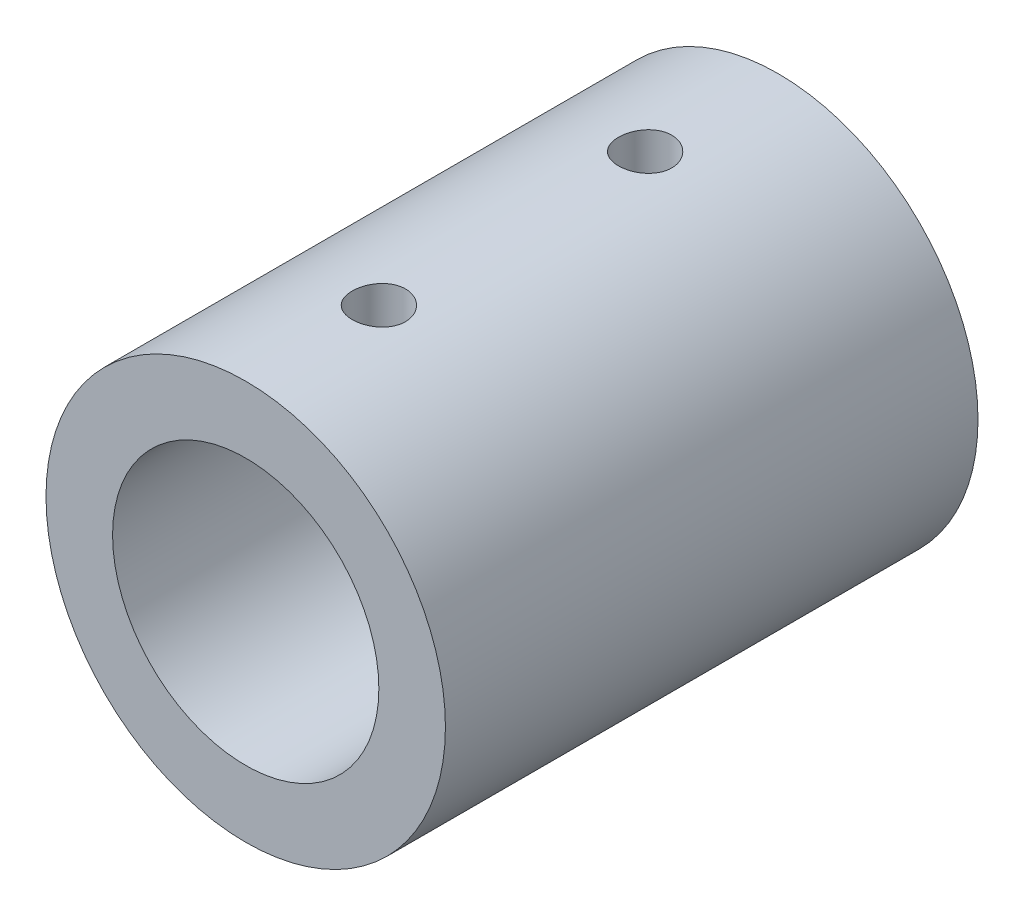
ISO-10303-21;
HEADER;
FILE_DESCRIPTION(('STEP AP214'),'2;1');
FILE_NAME('part.step','',(''),(''),'','','');
FILE_SCHEMA(('AUTOMOTIVE_DESIGN { 1 0 10303 214 1 1 1 1 }'));
ENDSEC;
DATA;
#1=APPLICATION_CONTEXT('core data for automotive mechanical design processes');
#2=APPLICATION_PROTOCOL_DEFINITION('international standard','automotive_design',2000,#1);
#3=PRODUCT_CONTEXT('',#1,'mechanical');
#4=PRODUCT('Part','Part','',(#3));
#5=PRODUCT_RELATED_PRODUCT_CATEGORY('part','',(#4));
#6=PRODUCT_DEFINITION_FORMATION('','',#4);
#7=PRODUCT_DEFINITION_CONTEXT('part definition',#1,'design');
#8=PRODUCT_DEFINITION('design','',#6,#7);
#9=PRODUCT_DEFINITION_SHAPE('','',#8);
#10=(LENGTH_UNIT() NAMED_UNIT(*) SI_UNIT(.MILLI.,.METRE.));
#11=(NAMED_UNIT(*) PLANE_ANGLE_UNIT() SI_UNIT($,.RADIAN.));
#12=(NAMED_UNIT(*) SI_UNIT($,.STERADIAN.) SOLID_ANGLE_UNIT());
#13=UNCERTAINTY_MEASURE_WITH_UNIT(LENGTH_MEASURE(1.E-05),#10,'distance_accuracy_value','');
#14=(GEOMETRIC_REPRESENTATION_CONTEXT(3) GLOBAL_UNCERTAINTY_ASSIGNED_CONTEXT((#13)) GLOBAL_UNIT_ASSIGNED_CONTEXT((#10,
#11,#12)) REPRESENTATION_CONTEXT('',''));
#15=CARTESIAN_POINT('',(0.,0.,0.));
#16=DIRECTION('',(0.,0.,1.));
#17=DIRECTION('',(1.,0.,0.));
#18=AXIS2_PLACEMENT_3D('',#15,#16,#17);
#19=CARTESIAN_POINT('',(0.,0.,-30.));
#20=DIRECTION('',(0.,0.,1.));
#21=DIRECTION('',(1.,0.,0.));
#22=AXIS2_PLACEMENT_3D('',#19,#20,#21);
#23=CYLINDRICAL_SURFACE('',#22,22.5);
#24=CARTESIAN_POINT('',(0.,22.5,-18.));
#25=CARTESIAN_POINT('',(-0.167713253503927,22.4999975361382,-17.9999929354396));
#26=CARTESIAN_POINT('',(-0.33552896891442,22.4981050609079,-17.9858886930563));
#27=CARTESIAN_POINT('',(-0.666484087707118,22.4907376669036,-17.9298504764257));
#28=CARTESIAN_POINT('',(-0.829618533499555,22.4852590866259,-17.8878880576543));
#29=CARTESIAN_POINT('',(-1.14637246894048,22.471336197736,-17.7773974236878));
#30=CARTESIAN_POINT('',(-1.29999852458774,22.4628939631646,-17.7088877834423));
#31=CARTESIAN_POINT('',(-1.59354584254545,22.4439807999059,-17.5472896292906));
#32=CARTESIAN_POINT('',(-1.73346930950554,22.4335101983785,-17.4542050782503));
#33=CARTESIAN_POINT('',(-1.99653873375702,22.4116349218495,-17.2454801075937));
#34=CARTESIAN_POINT('',(-2.11958697824379,22.4002253724317,-17.1297170324873));
#35=CARTESIAN_POINT('',(-2.34457103509652,22.3777970633693,-16.879184716385));
#36=CARTESIAN_POINT('',(-2.44650572995832,22.3667783244351,-16.7444144700063));
#37=CARTESIAN_POINT('',(-2.62673853403361,22.3463315316028,-16.4590513155824));
#38=CARTESIAN_POINT('',(-2.70494411223867,22.3369097664864,-16.3083994762821));
#39=CARTESIAN_POINT('',(-2.83490767510935,22.3207888106885,-15.9959533991448));
#40=CARTESIAN_POINT('',(-2.88666679867917,22.3140895027681,-15.83415964147));
#41=CARTESIAN_POINT('',(-2.96196910158261,22.30421904853,-15.5050412842475));
#42=CARTESIAN_POINT('',(-2.9856780634276,22.301027180552,-15.3377552482006));
#43=CARTESIAN_POINT('',(-3.00472020822176,22.2984697741397,-15.0015507305911));
#44=CARTESIAN_POINT('',(-3.00005468450402,22.299104061306,-14.8326323237837));
#45=CARTESIAN_POINT('',(-2.96261618908852,22.3041083365948,-14.4991183049581));
#46=CARTESIAN_POINT('',(-2.93002646297642,22.3084539693351,-14.3345017051714));
#47=CARTESIAN_POINT('',(-2.83795086951557,22.3203532916212,-14.0130947448599));
#48=CARTESIAN_POINT('',(-2.77846438892186,22.3279070543119,-13.8563045628675));
#49=CARTESIAN_POINT('',(-2.63408893714787,22.3453989166654,-13.5544355479392));
#50=CARTESIAN_POINT('',(-2.54912096870624,22.3553444118585,-13.4093949432085));
#51=CARTESIAN_POINT('',(-2.35625090016434,22.376493543299,-13.1355613771235));
#52=CARTESIAN_POINT('',(-2.24834760753577,22.3876972449529,-13.0067692611687));
#53=CARTESIAN_POINT('',(-2.01165735039544,22.4102084885038,-12.7680254811272));
#54=CARTESIAN_POINT('',(-1.88271256053967,22.421516153118,-12.6582302359465));
#55=CARTESIAN_POINT('',(-1.60814125520011,22.442878857274,-12.4618169326074));
#56=CARTESIAN_POINT('',(-1.46251469166355,22.4529338932073,-12.3751989412147));
#57=CARTESIAN_POINT('',(-1.15858832959571,22.4706659061537,-12.2275963234579));
#58=CARTESIAN_POINT('',(-1.00028336826185,22.4783419081344,-12.1666222034305));
#59=CARTESIAN_POINT('',(-0.675556386504375,22.4904423885611,-12.0721660215415));
#60=CARTESIAN_POINT('',(-0.509134799313386,22.4948670403489,-12.0386824940409));
#61=CARTESIAN_POINT('',(-0.174250354988466,22.4999436206528,-12.0003623508433));
#62=CARTESIAN_POINT('',(-0.00581255182056345,22.5006239077357,-11.9953103973248));
#63=CARTESIAN_POINT('',(0.329507425828077,22.4982118730778,-12.0134274961908));
#64=CARTESIAN_POINT('',(0.496389638018497,22.495119643029,-12.0365958626735));
#65=CARTESIAN_POINT('',(0.823220573359407,22.4855276303715,-12.110316980076));
#66=CARTESIAN_POINT('',(0.983193024768067,22.4790407145438,-12.1607663524832));
#67=CARTESIAN_POINT('',(1.29240764819034,22.4633851388143,-12.2875094489056));
#68=CARTESIAN_POINT('',(1.44164941052346,22.4542163765916,-12.3638041590199));
#69=CARTESIAN_POINT('',(1.72612331792412,22.4341475605511,-12.540588233375));
#70=CARTESIAN_POINT('',(1.86126872159491,22.4232377256857,-12.64121604857));
#71=CARTESIAN_POINT('',(2.11282942048785,22.4009359306497,-12.8636149938364));
#72=CARTESIAN_POINT('',(2.22924386493568,22.3895439486093,-12.9853870837747));
#73=CARTESIAN_POINT('',(2.44080824134647,22.3674735371027,-13.2475697139593));
#74=CARTESIAN_POINT('',(2.53581491413408,22.3568002316295,-13.3880963501072));
#75=CARTESIAN_POINT('',(2.70087526618221,22.3374619950273,-13.6832391154214));
#76=CARTESIAN_POINT('',(2.7709295026552,22.3287970190518,-13.8378549298656));
#77=CARTESIAN_POINT('',(2.88386754751119,22.3144921767012,-14.1563358630415));
#78=CARTESIAN_POINT('',(2.92683043270193,22.308843513489,-14.3201725278162));
#79=CARTESIAN_POINT('',(2.98462000715938,22.3011862304744,-14.6528154481931));
#80=CARTESIAN_POINT('',(2.99944820140173,22.2991774159701,-14.8216214374867));
#81=CARTESIAN_POINT('',(3.00051728709284,22.2990334694317,-15.1579852362803));
#82=CARTESIAN_POINT('',(2.98698328791739,22.3008678342378,-15.3255423614464));
#83=CARTESIAN_POINT('',(2.93219065030034,22.308137758113,-15.6559768126558));
#84=CARTESIAN_POINT('',(2.89093202224903,22.3135733158325,-15.818854140453));
#85=CARTESIAN_POINT('',(2.78193465498311,22.3274233540915,-16.1352655248774));
#86=CARTESIAN_POINT('',(2.71420831228562,22.335836439891,-16.2888039166753));
#87=CARTESIAN_POINT('',(2.55422014139606,22.3546956856923,-16.5823738257391));
#88=CARTESIAN_POINT('',(2.46195783945643,22.365141884949,-16.7224050821341));
#89=CARTESIAN_POINT('',(2.25468672764262,22.3869895077459,-16.9861344748926));
#90=CARTESIAN_POINT('',(2.13951040840351,22.3983975863112,-17.1097004216327));
#91=CARTESIAN_POINT('',(1.89003254024735,22.4208257850249,-17.3358348245423));
#92=CARTESIAN_POINT('',(1.75572651109466,22.4318458135347,-17.4383983481254));
#93=CARTESIAN_POINT('',(1.47112948177923,22.4523095270629,-17.6200007076998));
#94=CARTESIAN_POINT('',(1.32077193111595,22.4617461964033,-17.6989359998329));
#95=CARTESIAN_POINT('',(1.00888861438099,22.4779098098846,-17.8303208978176));
#96=CARTESIAN_POINT('',(0.847375018454833,22.4846396538647,-17.8827988629373));
#97=CARTESIAN_POINT('',(0.570882612147626,22.493035826149,-17.9474220095778));
#98=CARTESIAN_POINT('',(0.457636622933667,22.4956344545261,-17.9671098652855));
#99=CARTESIAN_POINT('',(0.229609757424167,22.4991173773616,-17.9934012212482));
#100=CARTESIAN_POINT('',(0.11482889467686,22.500001686942,-18.0000048369204));
#101=CARTESIAN_POINT('',(0.,22.5,-18.));
#102=B_SPLINE_CURVE_WITH_KNOTS('',3,(#24,#25,#26,#27,#28,#29,#30,#31,#32,#33,#34,#35,#36,#37,
#38,#39,#40,#41,#42,#43,#44,#45,#46,#47,#48,#49,#50,#51,#52,#53,#54,#55,#56,#57,#58,#59,#60,#61,
#62,#63,#64,#65,#66,#67,#68,#69,#70,#71,#72,#73,#74,#75,#76,#77,#78,#79,#80,#81,#82,#83,#84,#85,
#86,#87,#88,#89,#90,#91,#92,#93,#94,#95,#96,#97,#98,#99,#100,#101),.UNSPECIFIED.,.T.,.F.,(4,2,2,
2,2,2,2,2,2,2,2,2,2,2,2,2,2,2,2,2,2,2,2,2,2,2,2,2,2,2,2,2,2,2,2,2,2,2,4),(0.,0.502720276958615,
1.00595464632757,1.50883753924111,2.01163938846052,2.51723967665338,3.02286671857254,
3.53044082267471,4.03799306649307,4.54253033871538,5.0470446138738,5.54827327647065,
6.04951336763776,6.55232374706847,7.05516027665696,7.56195816727274,8.06875751778444,
8.57576430303808,9.08274405587614,9.58587877488091,10.0890012653172,10.590230450947,
11.0914787625532,11.5956491215483,12.0998423738814,12.6073155680318,13.1147774290957,
13.6207511210318,14.1266977467545,14.6286439124494,15.1305898900312,15.6323010555393,
16.1340219089385,16.6395550175266,17.1452067187674,17.6530429001177,18.1603335748863,
18.5045360857096,18.8487355602816),.UNSPECIFIED.);
#103=CARTESIAN_POINT('',(0.,22.5,-18.));
#104=VERTEX_POINT('',#103);
#105=EDGE_CURVE('E74',#104,#104,#102,.T.);
#106=ORIENTED_EDGE('',*,*,#105,.F.);
#107=EDGE_LOOP('',(#106));
#108=FACE_BOUND('',#107,.T.);
#109=CARTESIAN_POINT('',(0.,0.,30.));
#110=DIRECTION('',(0.,0.,1.));
#111=DIRECTION('',(1.,0.,0.));
#112=AXIS2_PLACEMENT_3D('',#109,#110,#111);
#113=CIRCLE('',#112,22.5);
#114=CARTESIAN_POINT('',(22.5,0.,30.));
#115=VERTEX_POINT('',#114);
#116=EDGE_CURVE('E63',#115,#115,#113,.T.);
#117=ORIENTED_EDGE('',*,*,#116,.F.);
#118=EDGE_LOOP('',(#117));
#119=FACE_BOUND('',#118,.T.);
#120=CARTESIAN_POINT('',(0.,0.,-30.));
#121=DIRECTION('',(0.,0.,1.));
#122=DIRECTION('',(1.,0.,0.));
#123=AXIS2_PLACEMENT_3D('',#120,#121,#122);
#124=CIRCLE('',#123,22.5);
#125=CARTESIAN_POINT('',(22.5,0.,-30.));
#126=VERTEX_POINT('',#125);
#127=EDGE_CURVE('E10',#126,#126,#124,.T.);
#128=ORIENTED_EDGE('',*,*,#127,.T.);
#129=EDGE_LOOP('',(#128));
#130=FACE_BOUND('',#129,.T.);
#131=CARTESIAN_POINT('',(0.,22.5,12.));
#132=CARTESIAN_POINT('',(0.167713253503927,22.4999975361382,12.0000070645604));
#133=CARTESIAN_POINT('',(0.33552896891442,22.4981050609079,12.0141113069437));
#134=CARTESIAN_POINT('',(0.666484087707118,22.4907376669036,12.0701495235743));
#135=CARTESIAN_POINT('',(0.829618533499555,22.4852590866259,12.1121119423457));
#136=CARTESIAN_POINT('',(1.14637246894048,22.471336197736,12.2226025763122));
#137=CARTESIAN_POINT('',(1.29999852458774,22.4628939631646,12.2911122165577));
#138=CARTESIAN_POINT('',(1.59354584254545,22.4439807999059,12.4527103707094));
#139=CARTESIAN_POINT('',(1.73346930950554,22.4335101983785,12.5457949217497));
#140=CARTESIAN_POINT('',(1.99653873375702,22.4116349218495,12.7545198924063));
#141=CARTESIAN_POINT('',(2.1195869782438,22.4002253724317,12.8702829675127));
#142=CARTESIAN_POINT('',(2.34457103509653,22.3777970633693,13.120815283615));
#143=CARTESIAN_POINT('',(2.44650572995832,22.3667783244351,13.2555855299937));
#144=CARTESIAN_POINT('',(2.62673853403361,22.3463315316028,13.5409486844175));
#145=CARTESIAN_POINT('',(2.70494411223867,22.3369097664864,13.6916005237179));
#146=CARTESIAN_POINT('',(2.83490767510935,22.3207888106885,14.0040466008552));
#147=CARTESIAN_POINT('',(2.88666679867917,22.3140895027681,14.16584035853));
#148=CARTESIAN_POINT('',(2.96196910158261,22.30421904853,14.4949587157525));
#149=CARTESIAN_POINT('',(2.9856780634276,22.301027180552,14.6622447517994));
#150=CARTESIAN_POINT('',(3.00472020822176,22.2984697741397,14.9984492694089));
#151=CARTESIAN_POINT('',(3.00005468450402,22.299104061306,15.1673676762163));
#152=CARTESIAN_POINT('',(2.96261618908852,22.3041083365948,15.5008816950419));
#153=CARTESIAN_POINT('',(2.93002646297642,22.3084539693351,15.6654982948286));
#154=CARTESIAN_POINT('',(2.83795086951557,22.3203532916212,15.9869052551401));
#155=CARTESIAN_POINT('',(2.77846438892186,22.3279070543119,16.1436954371325));
#156=CARTESIAN_POINT('',(2.63408893714787,22.3453989166654,16.4455644520608));
#157=CARTESIAN_POINT('',(2.54912096870624,22.3553444118585,16.5906050567915));
#158=CARTESIAN_POINT('',(2.35625090016434,22.376493543299,16.8644386228765));
#159=CARTESIAN_POINT('',(2.24834760753577,22.3876972449529,16.9932307388313));
#160=CARTESIAN_POINT('',(2.01165735039544,22.4102084885038,17.2319745188728));
#161=CARTESIAN_POINT('',(1.88271256053967,22.421516153118,17.3417697640535));
#162=CARTESIAN_POINT('',(1.60814125520011,22.442878857274,17.5381830673926));
#163=CARTESIAN_POINT('',(1.46251469166355,22.4529338932073,17.6248010587853));
#164=CARTESIAN_POINT('',(1.1585883295957,22.4706659061537,17.7724036765421));
#165=CARTESIAN_POINT('',(1.00028336826184,22.4783419081344,17.8333777965695));
#166=CARTESIAN_POINT('',(0.675556386504372,22.4904423885611,17.9278339784585));
#167=CARTESIAN_POINT('',(0.509134799313384,22.4948670403489,17.9613175059591));
#168=CARTESIAN_POINT('',(0.174250354988463,22.4999436206528,17.9996376491567));
#169=CARTESIAN_POINT('',(0.0058125518205612,22.5006239077357,18.0046896026752));
#170=CARTESIAN_POINT('',(-0.329507425828079,22.4982118730778,17.9865725038092));
#171=CARTESIAN_POINT('',(-0.496389638018499,22.495119643029,17.9634041373265));
#172=CARTESIAN_POINT('',(-0.82322057335941,22.4855276303715,17.889683019924));
#173=CARTESIAN_POINT('',(-0.983193024768071,22.4790407145438,17.8392336475168));
#174=CARTESIAN_POINT('',(-1.29240764819034,22.4633851388143,17.7124905510944));
#175=CARTESIAN_POINT('',(-1.44164941052346,22.4542163765916,17.6361958409801));
#176=CARTESIAN_POINT('',(-1.72612331792412,22.4341475605511,17.459411766625));
#177=CARTESIAN_POINT('',(-1.86126872159491,22.4232377256857,17.35878395143));
#178=CARTESIAN_POINT('',(-2.11282942048785,22.4009359306497,17.1363850061636));
#179=CARTESIAN_POINT('',(-2.22924386493568,22.3895439486093,17.0146129162253));
#180=CARTESIAN_POINT('',(-2.44080824134647,22.3674735371027,16.7524302860407));
#181=CARTESIAN_POINT('',(-2.53581491413408,22.3568002316295,16.6119036498928));
#182=CARTESIAN_POINT('',(-2.70087526618221,22.3374619950273,16.3167608845786));
#183=CARTESIAN_POINT('',(-2.7709295026552,22.3287970190518,16.1621450701344));
#184=CARTESIAN_POINT('',(-2.88386754751119,22.3144921767012,15.8436641369585));
#185=CARTESIAN_POINT('',(-2.92683043270193,22.308843513489,15.6798274721838));
#186=CARTESIAN_POINT('',(-2.98462000715938,22.3011862304744,15.3471845518069));
#187=CARTESIAN_POINT('',(-2.99944820140173,22.2991774159701,15.1783785625133));
#188=CARTESIAN_POINT('',(-3.00051728709284,22.2990334694317,14.8420147637197));
#189=CARTESIAN_POINT('',(-2.98698328791739,22.3008678342378,14.6744576385536));
#190=CARTESIAN_POINT('',(-2.93219065030034,22.308137758113,14.3440231873442));
#191=CARTESIAN_POINT('',(-2.89093202224903,22.3135733158325,14.181145859547));
#192=CARTESIAN_POINT('',(-2.78193465498311,22.3274233540915,13.8647344751226));
#193=CARTESIAN_POINT('',(-2.71420831228562,22.335836439891,13.7111960833247));
#194=CARTESIAN_POINT('',(-2.55422014139606,22.3546956856923,13.4176261742609));
#195=CARTESIAN_POINT('',(-2.46195783945643,22.365141884949,13.2775949178659));
#196=CARTESIAN_POINT('',(-2.25468672764262,22.3869895077459,13.0138655251074));
#197=CARTESIAN_POINT('',(-2.13951040840351,22.3983975863112,12.8902995783673));
#198=CARTESIAN_POINT('',(-1.89003254024735,22.4208257850249,12.6641651754577));
#199=CARTESIAN_POINT('',(-1.75572651109466,22.4318458135347,12.5616016518746));
#200=CARTESIAN_POINT('',(-1.47112948177923,22.4523095270629,12.3799992923002));
#201=CARTESIAN_POINT('',(-1.32077193111595,22.4617461964033,12.3010640001671));
#202=CARTESIAN_POINT('',(-1.00888861438099,22.4779098098846,12.1696791021824));
#203=CARTESIAN_POINT('',(-0.847375018454831,22.4846396538647,12.1172011370627));
#204=CARTESIAN_POINT('',(-0.570882612147626,22.493035826149,12.0525779904222));
#205=CARTESIAN_POINT('',(-0.457636622933666,22.4956344545261,12.0328901347145));
#206=CARTESIAN_POINT('',(-0.229609757424166,22.4991173773616,12.0065987787518));
#207=CARTESIAN_POINT('',(-0.11482889467686,22.500001686942,11.9999951630796));
#208=CARTESIAN_POINT('',(0.,22.5,12.));
#209=B_SPLINE_CURVE_WITH_KNOTS('',3,(#131,#132,#133,#134,#135,#136,#137,#138,#139,#140,#141,
#142,#143,#144,#145,#146,#147,#148,#149,#150,#151,#152,#153,#154,#155,#156,#157,#158,#159,#160,
#161,#162,#163,#164,#165,#166,#167,#168,#169,#170,#171,#172,#173,#174,#175,#176,#177,#178,#179,
#180,#181,#182,#183,#184,#185,#186,#187,#188,#189,#190,#191,#192,#193,#194,#195,#196,#197,#198,
#199,#200,#201,#202,#203,#204,#205,#206,#207,#208),.UNSPECIFIED.,.T.,.F.,(4,2,2,2,2,2,2,2,2,2,2,
2,2,2,2,2,2,2,2,2,2,2,2,2,2,2,2,2,2,2,2,2,2,2,2,2,2,2,4),(0.,0.502720276958615,1.00595464632757,
1.50883753924111,2.01163938846052,2.51723967665338,3.02286671857254,3.53044082267472,
4.03799306649307,4.54253033871538,5.0470446138738,5.54827327647066,6.04951336763776,
6.55232374706847,7.05516027665696,7.56195816727274,8.06875751778444,8.57576430303808,
9.08274405587615,9.58587877488092,10.0890012653172,10.590230450947,11.0914787625532,
11.5956491215483,12.0998423738814,12.6073155680318,13.1147774290957,13.6207511210318,
14.1266977467545,14.6286439124494,15.1305898900312,15.6323010555393,16.1340219089385,
16.6395550175266,17.1452067187674,17.6530429001177,18.1603335748863,18.5045360857096,
18.8487355602816),.UNSPECIFIED.);
#210=CARTESIAN_POINT('',(0.,22.5,12.));
#211=VERTEX_POINT('',#210);
#212=EDGE_CURVE('E73',#211,#211,#209,.T.);
#213=ORIENTED_EDGE('',*,*,#212,.T.);
#214=EDGE_LOOP('',(#213));
#215=FACE_BOUND('',#214,.T.);
#216=ADVANCED_FACE('F43',(#108,#119,#130,#215),#23,.T.);
#217=CARTESIAN_POINT('',(0.,0.,-30.));
#218=DIRECTION('',(0.,0.,1.));
#219=DIRECTION('',(1.,0.,0.));
#220=AXIS2_PLACEMENT_3D('',#217,#218,#219);
#221=CYLINDRICAL_SURFACE('',#220,15.);
#222=CARTESIAN_POINT('',(0.,15.,-18.));
#223=CARTESIAN_POINT('',(-0.1667307203779,14.9999969274261,-17.999993866505));
#224=CARTESIAN_POINT('',(-0.333538980604567,14.9971915553469,-17.9860534710971));
#225=CARTESIAN_POINT('',(-0.662440523067058,14.9862709686969,-17.9307044996543));
#226=CARTESIAN_POINT('',(-0.824529952624068,14.9781515358056,-17.8892741015955));
#227=CARTESIAN_POINT('',(-1.13919091578994,14.9575094783486,-17.7802761791376));
#228=CARTESIAN_POINT('',(-1.2917714037994,14.9449910723015,-17.7127336894659));
#229=CARTESIAN_POINT('',(-1.58342396659268,14.9169119410594,-17.5535032574661));
#230=CARTESIAN_POINT('',(-1.72249684522744,14.9013513970712,-17.4618167531784));
#231=CARTESIAN_POINT('',(-1.9850804319446,14.8686649598991,-17.2555845171257));
#232=CARTESIAN_POINT('',(-2.10838185347557,14.8515223651304,-17.1407749338264));
#233=CARTESIAN_POINT('',(-2.33411026982409,14.8177254135776,-16.8921227508249));
#234=CARTESIAN_POINT('',(-2.43653563431127,14.8010710950127,-16.7582786659946));
#235=CARTESIAN_POINT('',(-2.61849526004286,14.7699732543785,-16.4738514209644));
#236=CARTESIAN_POINT('',(-2.6978128165976,14.7555512209484,-16.3231270686109));
#237=CARTESIAN_POINT('',(-2.82991699974092,14.7307880417525,-16.0101545429878));
#238=CARTESIAN_POINT('',(-2.88270624731171,14.7204464928588,-15.847907509961));
#239=CARTESIAN_POINT('',(-2.95957589965448,14.7051841575661,-15.5187469082762));
#240=CARTESIAN_POINT('',(-2.98402349387633,14.7001941032156,-15.3519223675733));
#241=CARTESIAN_POINT('',(-3.00465638317836,14.6959912518188,-15.016470535907));
#242=CARTESIAN_POINT('',(-3.0008445681405,14.6967778640352,-14.8478434310396));
#243=CARTESIAN_POINT('',(-2.96536371930546,14.7039765344455,-14.516259635937));
#244=CARTESIAN_POINT('',(-2.93411562073172,14.7103035857629,-14.3532557831181));
#245=CARTESIAN_POINT('',(-2.84531365386915,14.7277363848,-14.034851770011));
#246=CARTESIAN_POINT('',(-2.78775852930204,14.7388423607334,-13.879451973243));
#247=CARTESIAN_POINT('',(-2.64757435102416,14.7646685550122,-13.5794542148892));
#248=CARTESIAN_POINT('',(-2.56477845369634,14.7794126944111,-13.4349363612925));
#249=CARTESIAN_POINT('',(-2.37658072371804,14.8108385631919,-13.1616874500816));
#250=CARTESIAN_POINT('',(-2.27117629307049,14.827520515151,-13.0329582094465));
#251=CARTESIAN_POINT('',(-2.03849980368175,14.8613106372439,-12.7925117926292));
#252=CARTESIAN_POINT('',(-1.91086848363734,14.8784210763271,-12.6811422964226));
#253=CARTESIAN_POINT('',(-1.63855507218603,14.9108654614323,-12.4813384610963));
#254=CARTESIAN_POINT('',(-1.49387276213817,14.9261993846692,-12.3929044161193));
#255=CARTESIAN_POINT('',(-1.19117816063676,14.9534007048266,-12.2414174723221));
#256=CARTESIAN_POINT('',(-1.0331454587559,14.9652626654482,-12.1784043190664));
#257=CARTESIAN_POINT('',(-0.708446929345994,14.9841422696357,-12.0799185778843));
#258=CARTESIAN_POINT('',(-0.541782150217349,14.9911605000159,-12.0444426537791));
#259=CARTESIAN_POINT('',(-0.207538216881452,14.999480156006,-12.0025306386172));
#260=CARTESIAN_POINT('',(-0.0400209849767292,15.0008752395741,-11.9956187413792));
#261=CARTESIAN_POINT('',(0.293774802578141,14.9980515579031,-12.0097495768265));
#262=CARTESIAN_POINT('',(0.460053427331379,14.9938331082434,-12.0307907380578));
#263=CARTESIAN_POINT('',(0.785116979839622,14.9803149602405,-12.0998351206319));
#264=CARTESIAN_POINT('',(0.943955845019709,14.9710612921262,-12.1475942054937));
#265=CARTESIAN_POINT('',(1.251370882499,14.948506561831,-12.2684519479674));
#266=CARTESIAN_POINT('',(1.39994628491262,14.9352051964268,-12.3415525040305));
#267=CARTESIAN_POINT('',(1.68462352105865,14.9057973459988,-12.5120474719539));
#268=CARTESIAN_POINT('',(1.82055038025656,14.8896585131116,-12.6097283431168));
#269=CARTESIAN_POINT('',(2.07425405735762,14.8564420448965,-12.8262275736218));
#270=CARTESIAN_POINT('',(2.19202892679229,14.8393643090516,-12.9450481991996));
#271=CARTESIAN_POINT('',(2.40792177232253,14.8058791067089,-13.2026200556734));
#272=CARTESIAN_POINT('',(2.50571310734597,14.7894858069991,-13.341647232664));
#273=CARTESIAN_POINT('',(2.67655626015362,14.7595257538858,-13.63443408407));
#274=CARTESIAN_POINT('',(2.74960906776871,14.7459588874003,-13.7881931687207));
#275=CARTESIAN_POINT('',(2.86845552474588,14.7233022175315,-14.1053047384486));
#276=CARTESIAN_POINT('',(2.91439049937315,14.7141892461656,-14.268602523631));
#277=CARTESIAN_POINT('',(2.97812595488159,14.7014231037608,-14.6008003604727));
#278=CARTESIAN_POINT('',(2.99593010467534,14.6977692207333,-14.769699678628));
#279=CARTESIAN_POINT('',(3.00276273260241,14.6963744889414,-15.105026593633));
#280=CARTESIAN_POINT('',(2.99230736421269,14.698527575679,-15.271443446781));
#281=CARTESIAN_POINT('',(2.94405691230018,14.7082672045384,-15.6000949497151));
#282=CARTESIAN_POINT('',(2.9062620483879,14.7158537030151,-15.7623296330844));
#283=CARTESIAN_POINT('',(2.80463570549686,14.7355579265748,-16.0776831337216));
#284=CARTESIAN_POINT('',(2.74086752015203,14.7476646305649,-16.2308230815072));
#285=CARTESIAN_POINT('',(2.58916393380481,14.7750514492251,-16.5243111622033));
#286=CARTESIAN_POINT('',(2.50122650632465,14.7903318299668,-16.6646582211754));
#287=CARTESIAN_POINT('',(2.30191774435924,14.8226688156968,-16.9311467164509));
#288=CARTESIAN_POINT('',(2.19017366170554,14.839751187291,-17.0570062958028));
#289=CARTESIAN_POINT('',(1.94719310703942,14.8735824561586,-17.2883586165875));
#290=CARTESIAN_POINT('',(1.81595216146,14.8903312758955,-17.3938466709518));
#291=CARTESIAN_POINT('',(1.53605288726474,14.9218149716391,-17.5825039318393));
#292=CARTESIAN_POINT('',(1.3872266532895,14.9365269365774,-17.6654280098401));
#293=CARTESIAN_POINT('',(1.0774990828222,14.96205375255,-17.8049583677898));
#294=CARTESIAN_POINT('',(0.916608782589378,14.9728721141585,-17.8615883685975));
#295=CARTESIAN_POINT('',(0.629464466771338,14.9872911778611,-17.9359558441341));
#296=CARTESIAN_POINT('',(0.504844992041354,14.9920290947535,-17.9599295811233));
#297=CARTESIAN_POINT('',(0.253498575630201,14.9983846241968,-17.9919537370751));
#298=CARTESIAN_POINT('',(0.126771701245857,15.0000023361946,-18.0000046635293));
#299=CARTESIAN_POINT('',(0.,15.,-18.));
#300=B_SPLINE_CURVE_WITH_KNOTS('',3,(#222,#223,#224,#225,#226,#227,#228,#229,#230,#231,#232,
#233,#234,#235,#236,#237,#238,#239,#240,#241,#242,#243,#244,#245,#246,#247,#248,#249,#250,#251,
#252,#253,#254,#255,#256,#257,#258,#259,#260,#261,#262,#263,#264,#265,#266,#267,#268,#269,#270,
#271,#272,#273,#274,#275,#276,#277,#278,#279,#280,#281,#282,#283,#284,#285,#286,#287,#288,#289,
#290,#291,#292,#293,#294,#295,#296,#297,#298,#299),.UNSPECIFIED.,.T.,.F.,(4,2,2,2,2,2,2,2,2,2,2,
2,2,2,2,2,2,2,2,2,2,2,2,2,2,2,2,2,2,2,2,2,2,2,2,2,2,2,4),(0.,0.499728391983775,
0.999853952073969,1.49950120575103,1.99911870669259,2.50479801033656,3.0105167902421,
3.52083585017768,4.03110448095592,4.53468555310762,5.03821512843675,5.53415181018835,
6.03011217761189,6.52942470610778,7.02879464249011,7.53714757474052,8.04550702619461,
8.55465824562072,9.06374777094108,9.56432207028796,10.064868229736,10.5609136185217,
11.0569961764807,11.5591519810008,12.0613616503779,12.5712188573768,13.081055661704,
13.5882114309817,14.0953010499124,14.593191677031,15.0910783047783,15.5877588375933,
16.084481027456,16.5896422871743,17.0949196359879,17.6054849002691,18.1155886655256,
18.4955632586968,18.8755257411299),.UNSPECIFIED.);
#301=CARTESIAN_POINT('',(0.,15.,-18.));
#302=VERTEX_POINT('',#301);
#303=EDGE_CURVE('E47',#302,#302,#300,.T.);
#304=ORIENTED_EDGE('',*,*,#303,.T.);
#305=EDGE_LOOP('',(#304));
#306=FACE_BOUND('',#305,.T.);
#307=CARTESIAN_POINT('',(0.,0.,-30.));
#308=DIRECTION('',(0.,0.,1.));
#309=DIRECTION('',(1.,0.,0.));
#310=AXIS2_PLACEMENT_3D('',#307,#308,#309);
#311=CIRCLE('',#310,15.);
#312=CARTESIAN_POINT('',(15.,0.,-30.));
#313=VERTEX_POINT('',#312);
#314=EDGE_CURVE('E57',#313,#313,#311,.T.);
#315=ORIENTED_EDGE('',*,*,#314,.F.);
#316=EDGE_LOOP('',(#315));
#317=FACE_BOUND('',#316,.T.);
#318=CARTESIAN_POINT('',(0.,0.,30.));
#319=DIRECTION('',(0.,0.,1.));
#320=DIRECTION('',(1.,0.,0.));
#321=AXIS2_PLACEMENT_3D('',#318,#319,#320);
#322=CIRCLE('',#321,15.);
#323=CARTESIAN_POINT('',(15.,0.,30.));
#324=VERTEX_POINT('',#323);
#325=EDGE_CURVE('E94',#324,#324,#322,.T.);
#326=ORIENTED_EDGE('',*,*,#325,.T.);
#327=EDGE_LOOP('',(#326));
#328=FACE_BOUND('',#327,.T.);
#329=CARTESIAN_POINT('',(0.,15.,12.));
#330=CARTESIAN_POINT('',(0.1667307203779,14.9999969274261,12.000006133495));
#331=CARTESIAN_POINT('',(0.333538980604567,14.9971915553469,12.0139465289029));
#332=CARTESIAN_POINT('',(0.662440523067058,14.9862709686969,12.0692955003457));
#333=CARTESIAN_POINT('',(0.824529952624068,14.9781515358056,12.1107258984045));
#334=CARTESIAN_POINT('',(1.13919091578994,14.9575094783486,12.2197238208624));
#335=CARTESIAN_POINT('',(1.2917714037994,14.9449910723015,12.2872663105341));
#336=CARTESIAN_POINT('',(1.58342396659268,14.9169119410594,12.4464967425339));
#337=CARTESIAN_POINT('',(1.72249684522744,14.9013513970712,12.5381832468216));
#338=CARTESIAN_POINT('',(1.9850804319446,14.8686649598991,12.7444154828743));
#339=CARTESIAN_POINT('',(2.10838185347557,14.8515223651304,12.8592250661736));
#340=CARTESIAN_POINT('',(2.33411026982409,14.8177254135776,13.1078772491751));
#341=CARTESIAN_POINT('',(2.43653563431127,14.8010710950127,13.2417213340054));
#342=CARTESIAN_POINT('',(2.61849526004286,14.7699732543785,13.5261485790356));
#343=CARTESIAN_POINT('',(2.6978128165976,14.7555512209484,13.6768729313891));
#344=CARTESIAN_POINT('',(2.82991699974092,14.7307880417525,13.9898454570122));
#345=CARTESIAN_POINT('',(2.88270624731171,14.7204464928588,14.152092490039));
#346=CARTESIAN_POINT('',(2.95957589965448,14.7051841575661,14.4812530917238));
#347=CARTESIAN_POINT('',(2.98402349387633,14.7001941032156,14.6480776324267));
#348=CARTESIAN_POINT('',(3.00465638317836,14.6959912518188,14.983529464093));
#349=CARTESIAN_POINT('',(3.0008445681405,14.6967778640352,15.1521565689604));
#350=CARTESIAN_POINT('',(2.96536371930546,14.7039765344455,15.483740364063));
#351=CARTESIAN_POINT('',(2.93411562073172,14.7103035857629,15.6467442168819));
#352=CARTESIAN_POINT('',(2.84531365386915,14.7277363848,15.965148229989));
#353=CARTESIAN_POINT('',(2.78775852930204,14.7388423607334,16.120548026757));
#354=CARTESIAN_POINT('',(2.64757435102416,14.7646685550122,16.4205457851108));
#355=CARTESIAN_POINT('',(2.56477845369634,14.7794126944111,16.5650636387075));
#356=CARTESIAN_POINT('',(2.37658072371803,14.8108385631919,16.8383125499184));
#357=CARTESIAN_POINT('',(2.27117629307049,14.827520515151,16.9670417905535));
#358=CARTESIAN_POINT('',(2.03849980368175,14.8613106372439,17.2074882073708));
#359=CARTESIAN_POINT('',(1.91086848363733,14.8784210763271,17.3188577035774));
#360=CARTESIAN_POINT('',(1.63855507218603,14.9108654614323,17.5186615389037));
#361=CARTESIAN_POINT('',(1.49387276213817,14.9261993846692,17.6070955838807));
#362=CARTESIAN_POINT('',(1.19117816063676,14.9534007048266,17.7585825276779));
#363=CARTESIAN_POINT('',(1.0331454587559,14.9652626654482,17.8215956809336));
#364=CARTESIAN_POINT('',(0.708446929345995,14.9841422696357,17.9200814221157));
#365=CARTESIAN_POINT('',(0.541782150217349,14.9911605000159,17.9555573462209));
#366=CARTESIAN_POINT('',(0.207538216881452,14.999480156006,17.9974693613828));
#367=CARTESIAN_POINT('',(0.040020984976729,15.0008752395741,18.0043812586208));
#368=CARTESIAN_POINT('',(-0.293774802578142,14.9980515579031,17.9902504231735));
#369=CARTESIAN_POINT('',(-0.460053427331379,14.9938331082434,17.9692092619422));
#370=CARTESIAN_POINT('',(-0.785116979839622,14.9803149602405,17.9001648793681));
#371=CARTESIAN_POINT('',(-0.943955845019709,14.9710612921262,17.8524057945063));
#372=CARTESIAN_POINT('',(-1.251370882499,14.948506561831,17.7315480520326));
#373=CARTESIAN_POINT('',(-1.39994628491262,14.9352051964268,17.6584474959695));
#374=CARTESIAN_POINT('',(-1.68462352105865,14.9057973459988,17.4879525280461));
#375=CARTESIAN_POINT('',(-1.82055038025656,14.8896585131116,17.3902716568832));
#376=CARTESIAN_POINT('',(-2.07425405735762,14.8564420448965,17.1737724263782));
#377=CARTESIAN_POINT('',(-2.19202892679229,14.8393643090516,17.0549518008004));
#378=CARTESIAN_POINT('',(-2.40792177232253,14.8058791067089,16.7973799443266));
#379=CARTESIAN_POINT('',(-2.50571310734596,14.7894858069991,16.658352767336));
#380=CARTESIAN_POINT('',(-2.67655626015362,14.7595257538858,16.36556591593));
#381=CARTESIAN_POINT('',(-2.74960906776871,14.7459588874003,16.2118068312793));
#382=CARTESIAN_POINT('',(-2.86845552474588,14.7233022175315,15.8946952615514));
#383=CARTESIAN_POINT('',(-2.91439049937315,14.7141892461656,15.731397476369));
#384=CARTESIAN_POINT('',(-2.97812595488159,14.7014231037608,15.3991996395273));
#385=CARTESIAN_POINT('',(-2.99593010467534,14.6977692207333,15.230300321372));
#386=CARTESIAN_POINT('',(-3.00276273260241,14.6963744889414,14.894973406367));
#387=CARTESIAN_POINT('',(-2.99230736421269,14.698527575679,14.728556553219));
#388=CARTESIAN_POINT('',(-2.94405691230018,14.7082672045384,14.3999050502849));
#389=CARTESIAN_POINT('',(-2.90626204838789,14.7158537030151,14.2376703669156));
#390=CARTESIAN_POINT('',(-2.80463570549686,14.7355579265748,13.9223168662784));
#391=CARTESIAN_POINT('',(-2.74086752015203,14.7476646305649,13.7691769184928));
#392=CARTESIAN_POINT('',(-2.58916393380481,14.7750514492251,13.4756888377967));
#393=CARTESIAN_POINT('',(-2.50122650632465,14.7903318299668,13.3353417788246));
#394=CARTESIAN_POINT('',(-2.30191774435924,14.8226688156968,13.0688532835491));
#395=CARTESIAN_POINT('',(-2.19017366170554,14.839751187291,12.9429937041972));
#396=CARTESIAN_POINT('',(-1.94719310703942,14.8735824561586,12.7116413834125));
#397=CARTESIAN_POINT('',(-1.81595216146001,14.8903312758955,12.6061533290482));
#398=CARTESIAN_POINT('',(-1.53605288726474,14.9218149716391,12.4174960681607));
#399=CARTESIAN_POINT('',(-1.38722665328951,14.9365269365774,12.3345719901599));
#400=CARTESIAN_POINT('',(-1.0774990828222,14.96205375255,12.1950416322102));
#401=CARTESIAN_POINT('',(-0.91660878258938,14.9728721141585,12.1384116314025));
#402=CARTESIAN_POINT('',(-0.62946446677134,14.9872911778611,12.0640441558659));
#403=CARTESIAN_POINT('',(-0.504844992041356,14.9920290947536,12.0400704188767));
#404=CARTESIAN_POINT('',(-0.253498575630203,14.9983846241968,12.0080462629249));
#405=CARTESIAN_POINT('',(-0.126771701245858,15.0000023361946,11.9999953364707));
#406=CARTESIAN_POINT('',(0.,15.,12.));
#407=B_SPLINE_CURVE_WITH_KNOTS('',3,(#329,#330,#331,#332,#333,#334,#335,#336,#337,#338,#339,
#340,#341,#342,#343,#344,#345,#346,#347,#348,#349,#350,#351,#352,#353,#354,#355,#356,#357,#358,
#359,#360,#361,#362,#363,#364,#365,#366,#367,#368,#369,#370,#371,#372,#373,#374,#375,#376,#377,
#378,#379,#380,#381,#382,#383,#384,#385,#386,#387,#388,#389,#390,#391,#392,#393,#394,#395,#396,
#397,#398,#399,#400,#401,#402,#403,#404,#405,#406),.UNSPECIFIED.,.T.,.F.,(4,2,2,2,2,2,2,2,2,2,2,
2,2,2,2,2,2,2,2,2,2,2,2,2,2,2,2,2,2,2,2,2,2,2,2,2,2,2,4),(0.,0.499728391983776,0.99985395207397,
1.49950120575103,1.99911870669259,2.50479801033656,3.0105167902421,3.52083585017768,
4.03110448095592,4.53468555310762,5.03821512843675,5.53415181018836,6.03011217761189,
6.52942470610778,7.02879464249012,7.53714757474052,8.04550702619461,8.55465824562072,
9.06374777094108,9.56432207028796,10.064868229736,10.5609136185217,11.0569961764807,
11.5591519810008,12.0613616503779,12.5712188573768,13.081055661704,13.5882114309817,
14.0953010499124,14.593191677031,15.0910783047783,15.5877588375933,16.084481027456,
16.5896422871743,17.0949196359879,17.6054849002691,18.1155886655256,18.4955632586968,
18.8755257411299),.UNSPECIFIED.);
#408=CARTESIAN_POINT('',(0.,15.,12.));
#409=VERTEX_POINT('',#408);
#410=EDGE_CURVE('E66',#409,#409,#407,.T.);
#411=ORIENTED_EDGE('',*,*,#410,.F.);
#412=EDGE_LOOP('',(#411));
#413=FACE_BOUND('',#412,.T.);
#414=ADVANCED_FACE('F75',(#306,#317,#328,#413),#221,.F.);
#415=CARTESIAN_POINT('',(0.,0.,-30.));
#416=DIRECTION('',(0.,0.,1.));
#417=DIRECTION('',(1.,0.,0.));
#418=AXIS2_PLACEMENT_3D('',#415,#416,#417);
#419=PLANE('',#418);
#420=ORIENTED_EDGE('',*,*,#314,.T.);
#421=EDGE_LOOP('',(#420));
#422=FACE_BOUND('',#421,.T.);
#423=ORIENTED_EDGE('',*,*,#127,.F.);
#424=EDGE_LOOP('',(#423));
#425=FACE_BOUND('',#424,.T.);
#426=ADVANCED_FACE('F114',(#422,#425),#419,.F.);
#427=CARTESIAN_POINT('',(0.,0.,30.));
#428=DIRECTION('',(0.,0.,1.));
#429=DIRECTION('',(1.,0.,0.));
#430=AXIS2_PLACEMENT_3D('',#427,#428,#429);
#431=PLANE('',#430);
#432=ORIENTED_EDGE('',*,*,#116,.T.);
#433=EDGE_LOOP('',(#432));
#434=FACE_BOUND('',#433,.T.);
#435=ORIENTED_EDGE('',*,*,#325,.F.);
#436=EDGE_LOOP('',(#435));
#437=FACE_BOUND('',#436,.T.);
#438=ADVANCED_FACE('F82',(#434,#437),#431,.T.);
#439=CARTESIAN_POINT('',(0.,30.,15.));
#440=DIRECTION('',(0.,-1.,0.));
#441=DIRECTION('',(0.,0.,-1.));
#442=AXIS2_PLACEMENT_3D('',#439,#440,#441);
#443=CYLINDRICAL_SURFACE('',#442,3.);
#444=ORIENTED_EDGE('',*,*,#212,.F.);
#445=EDGE_LOOP('',(#444));
#446=FACE_BOUND('',#445,.T.);
#447=ORIENTED_EDGE('',*,*,#410,.T.);
#448=EDGE_LOOP('',(#447));
#449=FACE_BOUND('',#448,.T.);
#450=ADVANCED_FACE('F78',(#446,#449),#443,.F.);
#451=CARTESIAN_POINT('',(0.,30.,-15.));
#452=DIRECTION('',(0.,-1.,0.));
#453=DIRECTION('',(0.,0.,-1.));
#454=AXIS2_PLACEMENT_3D('',#451,#452,#453);
#455=CYLINDRICAL_SURFACE('',#454,3.);
#456=ORIENTED_EDGE('',*,*,#105,.T.);
#457=EDGE_LOOP('',(#456));
#458=FACE_BOUND('',#457,.T.);
#459=ORIENTED_EDGE('',*,*,#303,.F.);
#460=EDGE_LOOP('',(#459));
#461=FACE_BOUND('',#460,.T.);
#462=ADVANCED_FACE('F81',(#458,#461),#455,.F.);
#463=CLOSED_SHELL('',(#216,#414,#426,#438,#450,#462));
#464=MANIFOLD_SOLID_BREP('B2',#463);
#465=ADVANCED_BREP_SHAPE_REPRESENTATION('',(#18,#464),#14);
#466=SHAPE_DEFINITION_REPRESENTATION(#9,#465);
ENDSEC;
END-ISO-10303-21;
